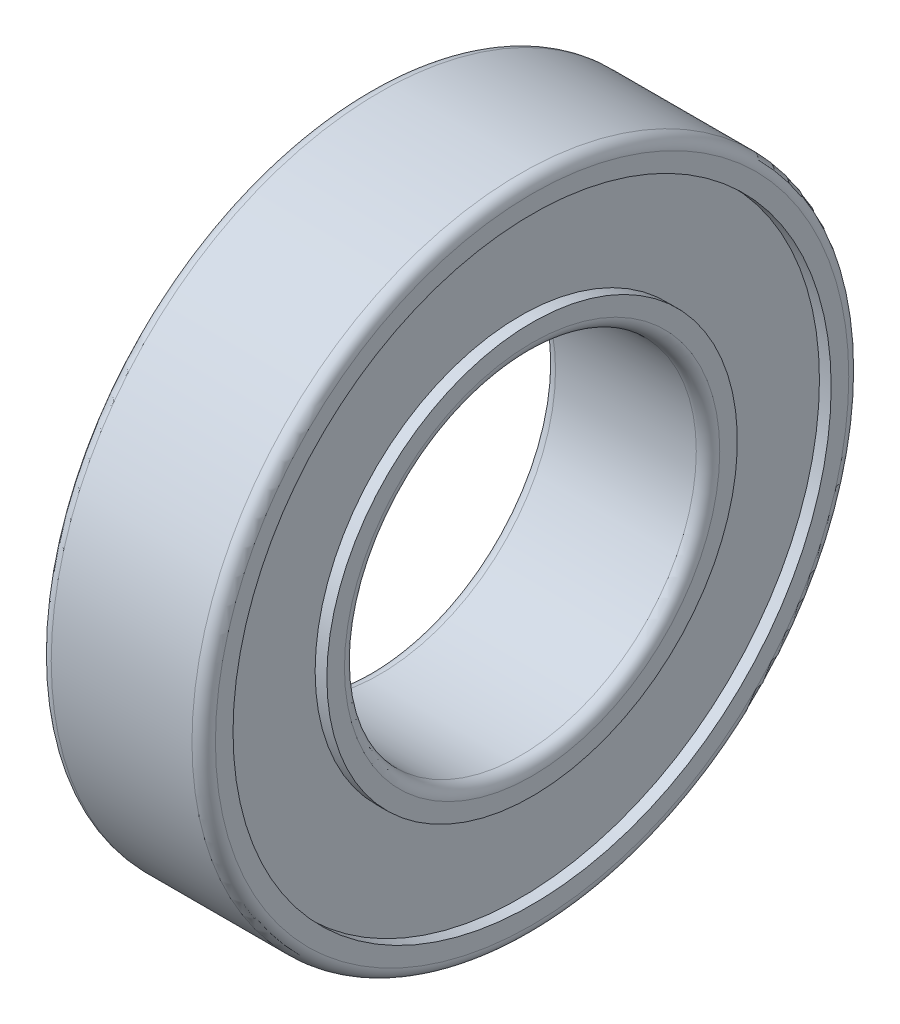
ISO-10303-21;
HEADER;
FILE_DESCRIPTION(('STEP AP214'),'2;1');
FILE_NAME('part.step','',(''),(''),'','','');
FILE_SCHEMA(('AUTOMOTIVE_DESIGN { 1 0 10303 214 1 1 1 1 }'));
ENDSEC;
DATA;
#1=APPLICATION_CONTEXT('core data for automotive mechanical design processes');
#2=APPLICATION_PROTOCOL_DEFINITION('international standard','automotive_design',2000,#1);
#3=PRODUCT_CONTEXT('',#1,'mechanical');
#4=PRODUCT('Part','Part','',(#3));
#5=PRODUCT_RELATED_PRODUCT_CATEGORY('part','',(#4));
#6=PRODUCT_DEFINITION_FORMATION('','',#4);
#7=PRODUCT_DEFINITION_CONTEXT('part definition',#1,'design');
#8=PRODUCT_DEFINITION('design','',#6,#7);
#9=PRODUCT_DEFINITION_SHAPE('','',#8);
#10=(LENGTH_UNIT() NAMED_UNIT(*) SI_UNIT(.MILLI.,.METRE.));
#11=(NAMED_UNIT(*) PLANE_ANGLE_UNIT() SI_UNIT($,.RADIAN.));
#12=(NAMED_UNIT(*) SI_UNIT($,.STERADIAN.) SOLID_ANGLE_UNIT());
#13=UNCERTAINTY_MEASURE_WITH_UNIT(LENGTH_MEASURE(1.E-05),#10,'distance_accuracy_value','');
#14=(GEOMETRIC_REPRESENTATION_CONTEXT(3) GLOBAL_UNCERTAINTY_ASSIGNED_CONTEXT((#13)) GLOBAL_UNIT_ASSIGNED_CONTEXT((#10,
#11,#12)) REPRESENTATION_CONTEXT('',''));
#15=CARTESIAN_POINT('',(0.,0.,0.));
#16=DIRECTION('',(0.,0.,1.));
#17=DIRECTION('',(1.,0.,0.));
#18=AXIS2_PLACEMENT_3D('',#15,#16,#17);
#19=CARTESIAN_POINT('',(0.5,12.75,0.));
#20=DIRECTION('',(1.,0.,0.));
#21=DIRECTION('',(0.,0.,-1.));
#22=AXIS2_PLACEMENT_3D('',#19,#20,#21);
#23=PLANE('',#22);
#24=CARTESIAN_POINT('',(0.5,0.,0.));
#25=DIRECTION('',(-1.,0.,0.));
#26=DIRECTION('',(0.,0.,1.));
#27=AXIS2_PLACEMENT_3D('',#24,#25,#26);
#28=CIRCLE('',#27,12.75);
#29=CARTESIAN_POINT('',(0.5,0.,12.75));
#30=VERTEX_POINT('',#29);
#31=EDGE_CURVE('E298',#30,#30,#28,.T.);
#32=ORIENTED_EDGE('',*,*,#31,.T.);
#33=EDGE_LOOP('',(#32));
#34=FACE_BOUND('',#33,.T.);
#35=CARTESIAN_POINT('',(0.5,0.,0.));
#36=DIRECTION('',(-1.,0.,0.));
#37=DIRECTION('',(0.,0.,1.));
#38=AXIS2_PLACEMENT_3D('',#35,#36,#37);
#39=CIRCLE('',#38,8.75);
#40=CARTESIAN_POINT('',(0.5,0.,8.75));
#41=VERTEX_POINT('',#40);
#42=EDGE_CURVE('E296',#41,#41,#39,.T.);
#43=ORIENTED_EDGE('',*,*,#42,.F.);
#44=EDGE_LOOP('',(#43));
#45=FACE_BOUND('',#44,.T.);
#46=ADVANCED_FACE('F16',(#34,#45),#23,.F.);
#47=CARTESIAN_POINT('',(0.,0.,0.));
#48=DIRECTION('',(-1.,0.,0.));
#49=DIRECTION('',(0.,0.,1.));
#50=AXIS2_PLACEMENT_3D('',#47,#48,#49);
#51=CYLINDRICAL_SURFACE('',#50,12.75);
#52=ORIENTED_EDGE('',*,*,#31,.F.);
#53=EDGE_LOOP('',(#52));
#54=FACE_BOUND('',#53,.T.);
#55=CARTESIAN_POINT('',(0.,0.,0.));
#56=DIRECTION('',(-1.,0.,0.));
#57=DIRECTION('',(0.,0.,1.));
#58=AXIS2_PLACEMENT_3D('',#55,#56,#57);
#59=CIRCLE('',#58,12.75);
#60=CARTESIAN_POINT('',(0.,0.,12.75));
#61=VERTEX_POINT('',#60);
#62=EDGE_CURVE('E293',#61,#61,#59,.T.);
#63=ORIENTED_EDGE('',*,*,#62,.T.);
#64=EDGE_LOOP('',(#63));
#65=FACE_BOUND('',#64,.T.);
#66=ADVANCED_FACE('F101',(#54,#65),#51,.F.);
#67=CARTESIAN_POINT('',(0.,0.,0.));
#68=DIRECTION('',(-1.,0.,0.));
#69=DIRECTION('',(0.,0.,1.));
#70=AXIS2_PLACEMENT_3D('',#67,#68,#69);
#71=CYLINDRICAL_SURFACE('',#70,8.75);
#72=CARTESIAN_POINT('',(0.,0.,0.));
#73=DIRECTION('',(-1.,0.,0.));
#74=DIRECTION('',(0.,0.,1.));
#75=AXIS2_PLACEMENT_3D('',#72,#73,#74);
#76=CIRCLE('',#75,8.75);
#77=CARTESIAN_POINT('',(0.,0.,8.75));
#78=VERTEX_POINT('',#77);
#79=EDGE_CURVE('E69',#78,#78,#76,.F.);
#80=ORIENTED_EDGE('',*,*,#79,.T.);
#81=EDGE_LOOP('',(#80));
#82=FACE_BOUND('',#81,.T.);
#83=ORIENTED_EDGE('',*,*,#42,.T.);
#84=EDGE_LOOP('',(#83));
#85=FACE_BOUND('',#84,.T.);
#86=ADVANCED_FACE('F89',(#82,#85),#71,.T.);
#87=CARTESIAN_POINT('',(0.,14.,0.));
#88=DIRECTION('',(1.,0.,0.));
#89=DIRECTION('',(0.,0.,-1.));
#90=AXIS2_PLACEMENT_3D('',#87,#88,#89);
#91=PLANE('',#90);
#92=ORIENTED_EDGE('',*,*,#62,.F.);
#93=EDGE_LOOP('',(#92));
#94=FACE_BOUND('',#93,.T.);
#95=CARTESIAN_POINT('',(0.,0.,0.));
#96=DIRECTION('',(1.,0.,0.));
#97=DIRECTION('',(0.,0.,-1.));
#98=AXIS2_PLACEMENT_3D('',#95,#96,#97);
#99=CIRCLE('',#98,13.5);
#100=CARTESIAN_POINT('',(0.,0.,-13.5));
#101=VERTEX_POINT('',#100);
#102=CARTESIAN_POINT('',(0.,0.,13.5));
#103=VERTEX_POINT('',#102);
#104=EDGE_CURVE('E56',#101,#103,#99,.T.);
#105=ORIENTED_EDGE('',*,*,#104,.F.);
#106=CARTESIAN_POINT('',(0.,0.,0.));
#107=DIRECTION('',(1.,0.,0.));
#108=DIRECTION('',(0.,0.,1.));
#109=AXIS2_PLACEMENT_3D('',#106,#107,#108);
#110=CIRCLE('',#109,13.5);
#111=EDGE_CURVE('E58',#103,#101,#110,.T.);
#112=ORIENTED_EDGE('',*,*,#111,.F.);
#113=EDGE_LOOP('',(#105,#112));
#114=FACE_BOUND('',#113,.T.);
#115=ADVANCED_FACE('F68',(#94,#114),#91,.F.);
#116=CARTESIAN_POINT('',(0.,8.75,0.));
#117=DIRECTION('',(1.,0.,0.));
#118=DIRECTION('',(0.,0.,-1.));
#119=AXIS2_PLACEMENT_3D('',#116,#117,#118);
#120=PLANE('',#119);
#121=ORIENTED_EDGE('',*,*,#79,.F.);
#122=EDGE_LOOP('',(#121));
#123=FACE_BOUND('',#122,.T.);
#124=CARTESIAN_POINT('',(0.,0.,0.));
#125=DIRECTION('',(-1.,0.,0.));
#126=DIRECTION('',(0.,0.,-1.));
#127=AXIS2_PLACEMENT_3D('',#124,#125,#126);
#128=CIRCLE('',#127,8.);
#129=CARTESIAN_POINT('',(0.,0.,-8.));
#130=VERTEX_POINT('',#129);
#131=CARTESIAN_POINT('',(0.,0.,8.));
#132=VERTEX_POINT('',#131);
#133=EDGE_CURVE('E64',#130,#132,#128,.T.);
#134=ORIENTED_EDGE('',*,*,#133,.F.);
#135=CARTESIAN_POINT('',(0.,0.,0.));
#136=DIRECTION('',(-1.,0.,0.));
#137=DIRECTION('',(0.,0.,1.));
#138=AXIS2_PLACEMENT_3D('',#135,#136,#137);
#139=CIRCLE('',#138,8.);
#140=EDGE_CURVE('E240',#132,#130,#139,.T.);
#141=ORIENTED_EDGE('',*,*,#140,.F.);
#142=EDGE_LOOP('',(#134,#141));
#143=FACE_BOUND('',#142,.T.);
#144=ADVANCED_FACE('F88',(#123,#143),#120,.F.);
#145=CARTESIAN_POINT('',(0.500000000000002,0.,0.));
#146=DIRECTION('',(1.,0.,0.));
#147=DIRECTION('',(0.,0.,-1.));
#148=AXIS2_PLACEMENT_3D('',#145,#146,#147);
#149=TOROIDAL_SURFACE('',#148,13.5,0.5);
#150=ORIENTED_EDGE('',*,*,#104,.T.);
#151=ORIENTED_EDGE('',*,*,#111,.T.);
#152=EDGE_LOOP('',(#150,#151));
#153=FACE_BOUND('',#152,.T.);
#154=CARTESIAN_POINT('',(0.500000000000002,0.,0.));
#155=DIRECTION('',(-1.,0.,0.));
#156=DIRECTION('',(0.,0.,1.));
#157=AXIS2_PLACEMENT_3D('',#154,#155,#156);
#158=CIRCLE('',#157,14.);
#159=CARTESIAN_POINT('',(0.500000000000002,0.,14.));
#160=VERTEX_POINT('',#159);
#161=EDGE_CURVE('E237',#160,#160,#158,.F.);
#162=ORIENTED_EDGE('',*,*,#161,.F.);
#163=EDGE_LOOP('',(#162));
#164=FACE_BOUND('',#163,.T.);
#165=ADVANCED_FACE('F60',(#153,#164),#149,.T.);
#166=CARTESIAN_POINT('',(0.5,0.,0.));
#167=DIRECTION('',(1.,0.,0.));
#168=DIRECTION('',(0.,0.,-1.));
#169=AXIS2_PLACEMENT_3D('',#166,#167,#168);
#170=TOROIDAL_SURFACE('',#169,8.,0.5);
#171=ORIENTED_EDGE('',*,*,#133,.T.);
#172=ORIENTED_EDGE('',*,*,#140,.T.);
#173=EDGE_LOOP('',(#171,#172));
#174=FACE_BOUND('',#173,.T.);
#175=CARTESIAN_POINT('',(0.5,0.,0.));
#176=DIRECTION('',(-1.,0.,0.));
#177=DIRECTION('',(0.,0.,1.));
#178=AXIS2_PLACEMENT_3D('',#175,#176,#177);
#179=CIRCLE('',#178,7.5);
#180=CARTESIAN_POINT('',(0.5,0.,7.5));
#181=VERTEX_POINT('',#180);
#182=EDGE_CURVE('E233',#181,#181,#179,.F.);
#183=ORIENTED_EDGE('',*,*,#182,.T.);
#184=EDGE_LOOP('',(#183));
#185=FACE_BOUND('',#184,.T.);
#186=ADVANCED_FACE('F217',(#174,#185),#170,.T.);
#187=CARTESIAN_POINT('',(0.,0.,0.));
#188=DIRECTION('',(-1.,0.,0.));
#189=DIRECTION('',(0.,0.,1.));
#190=AXIS2_PLACEMENT_3D('',#187,#188,#189);
#191=CYLINDRICAL_SURFACE('',#190,14.);
#192=CARTESIAN_POINT('',(6.5,0.,0.));
#193=DIRECTION('',(-1.,0.,0.));
#194=DIRECTION('',(0.,0.,1.));
#195=AXIS2_PLACEMENT_3D('',#192,#193,#194);
#196=CIRCLE('',#195,14.);
#197=CARTESIAN_POINT('',(6.5,0.,14.));
#198=VERTEX_POINT('',#197);
#199=EDGE_CURVE('E263',#198,#198,#196,.F.);
#200=ORIENTED_EDGE('',*,*,#199,.F.);
#201=EDGE_LOOP('',(#200));
#202=FACE_BOUND('',#201,.T.);
#203=ORIENTED_EDGE('',*,*,#161,.T.);
#204=EDGE_LOOP('',(#203));
#205=FACE_BOUND('',#204,.T.);
#206=ADVANCED_FACE('F227',(#202,#205),#191,.T.);
#207=CARTESIAN_POINT('',(0.,0.,0.));
#208=DIRECTION('',(-1.,0.,0.));
#209=DIRECTION('',(0.,0.,1.));
#210=AXIS2_PLACEMENT_3D('',#207,#208,#209);
#211=CYLINDRICAL_SURFACE('',#210,7.5);
#212=CARTESIAN_POINT('',(6.5,0.,0.));
#213=DIRECTION('',(-1.,0.,0.));
#214=DIRECTION('',(0.,0.,1.));
#215=AXIS2_PLACEMENT_3D('',#212,#213,#214);
#216=CIRCLE('',#215,7.5);
#217=CARTESIAN_POINT('',(6.5,0.,7.5));
#218=VERTEX_POINT('',#217);
#219=EDGE_CURVE('E265',#218,#218,#216,.T.);
#220=ORIENTED_EDGE('',*,*,#219,.F.);
#221=EDGE_LOOP('',(#220));
#222=FACE_BOUND('',#221,.T.);
#223=ORIENTED_EDGE('',*,*,#182,.F.);
#224=EDGE_LOOP('',(#223));
#225=FACE_BOUND('',#224,.T.);
#226=ADVANCED_FACE('F324',(#222,#225),#211,.F.);
#227=CARTESIAN_POINT('',(6.5,0.,0.));
#228=DIRECTION('',(-1.,0.,0.));
#229=DIRECTION('',(0.,0.,1.));
#230=AXIS2_PLACEMENT_3D('',#227,#228,#229);
#231=TOROIDAL_SURFACE('',#230,13.5,0.5);
#232=CARTESIAN_POINT('',(7.,0.,0.));
#233=DIRECTION('',(-1.,0.,0.));
#234=DIRECTION('',(0.,0.,1.));
#235=AXIS2_PLACEMENT_3D('',#232,#233,#234);
#236=CIRCLE('',#235,13.5);
#237=CARTESIAN_POINT('',(7.,0.,13.5));
#238=VERTEX_POINT('',#237);
#239=CARTESIAN_POINT('',(7.,0.,-13.5));
#240=VERTEX_POINT('',#239);
#241=EDGE_CURVE('E155',#238,#240,#236,.T.);
#242=ORIENTED_EDGE('',*,*,#241,.T.);
#243=CARTESIAN_POINT('',(7.,0.,0.));
#244=DIRECTION('',(-1.,0.,0.));
#245=DIRECTION('',(0.,0.,-1.));
#246=AXIS2_PLACEMENT_3D('',#243,#244,#245);
#247=CIRCLE('',#246,13.5);
#248=EDGE_CURVE('E166',#240,#238,#247,.T.);
#249=ORIENTED_EDGE('',*,*,#248,.T.);
#250=EDGE_LOOP('',(#242,#249));
#251=FACE_BOUND('',#250,.T.);
#252=ORIENTED_EDGE('',*,*,#199,.T.);
#253=EDGE_LOOP('',(#252));
#254=FACE_BOUND('',#253,.T.);
#255=ADVANCED_FACE('F182',(#251,#254),#231,.T.);
#256=CARTESIAN_POINT('',(6.5,0.,0.));
#257=DIRECTION('',(-1.,0.,0.));
#258=DIRECTION('',(0.,0.,1.));
#259=AXIS2_PLACEMENT_3D('',#256,#257,#258);
#260=TOROIDAL_SURFACE('',#259,8.,0.5);
#261=CARTESIAN_POINT('',(7.,0.,0.));
#262=DIRECTION('',(1.,0.,0.));
#263=DIRECTION('',(0.,0.,1.));
#264=AXIS2_PLACEMENT_3D('',#261,#262,#263);
#265=CIRCLE('',#264,8.);
#266=CARTESIAN_POINT('',(7.,0.,8.));
#267=VERTEX_POINT('',#266);
#268=CARTESIAN_POINT('',(7.,0.,-8.));
#269=VERTEX_POINT('',#268);
#270=EDGE_CURVE('E280',#267,#269,#265,.T.);
#271=ORIENTED_EDGE('',*,*,#270,.T.);
#272=CARTESIAN_POINT('',(7.,0.,0.));
#273=DIRECTION('',(1.,0.,0.));
#274=DIRECTION('',(0.,0.,-1.));
#275=AXIS2_PLACEMENT_3D('',#272,#273,#274);
#276=CIRCLE('',#275,8.);
#277=EDGE_CURVE('E35',#269,#267,#276,.T.);
#278=ORIENTED_EDGE('',*,*,#277,.T.);
#279=EDGE_LOOP('',(#271,#278));
#280=FACE_BOUND('',#279,.T.);
#281=ORIENTED_EDGE('',*,*,#219,.T.);
#282=EDGE_LOOP('',(#281));
#283=FACE_BOUND('',#282,.T.);
#284=ADVANCED_FACE('F178',(#280,#283),#260,.T.);
#285=CARTESIAN_POINT('',(7.,12.75,0.));
#286=DIRECTION('',(-1.,0.,0.));
#287=DIRECTION('',(0.,0.,1.));
#288=AXIS2_PLACEMENT_3D('',#285,#286,#287);
#289=PLANE('',#288);
#290=CARTESIAN_POINT('',(7.,0.,0.));
#291=DIRECTION('',(-1.,0.,0.));
#292=DIRECTION('',(0.,0.,1.));
#293=AXIS2_PLACEMENT_3D('',#290,#291,#292);
#294=CIRCLE('',#293,12.75);
#295=CARTESIAN_POINT('',(7.,0.,12.75));
#296=VERTEX_POINT('',#295);
#297=EDGE_CURVE('E281',#296,#296,#294,.T.);
#298=ORIENTED_EDGE('',*,*,#297,.T.);
#299=EDGE_LOOP('',(#298));
#300=FACE_BOUND('',#299,.T.);
#301=ORIENTED_EDGE('',*,*,#241,.F.);
#302=ORIENTED_EDGE('',*,*,#248,.F.);
#303=EDGE_LOOP('',(#301,#302));
#304=FACE_BOUND('',#303,.T.);
#305=ADVANCED_FACE('F134',(#300,#304),#289,.F.);
#306=CARTESIAN_POINT('',(7.,7.5,0.));
#307=DIRECTION('',(-1.,0.,0.));
#308=DIRECTION('',(0.,0.,1.));
#309=AXIS2_PLACEMENT_3D('',#306,#307,#308);
#310=PLANE('',#309);
#311=CARTESIAN_POINT('',(7.,0.,0.));
#312=DIRECTION('',(-1.,0.,0.));
#313=DIRECTION('',(0.,0.,1.));
#314=AXIS2_PLACEMENT_3D('',#311,#312,#313);
#315=CIRCLE('',#314,8.75);
#316=CARTESIAN_POINT('',(7.,0.,8.75));
#317=VERTEX_POINT('',#316);
#318=EDGE_CURVE('E283',#317,#317,#315,.T.);
#319=ORIENTED_EDGE('',*,*,#318,.F.);
#320=EDGE_LOOP('',(#319));
#321=FACE_BOUND('',#320,.T.);
#322=ORIENTED_EDGE('',*,*,#270,.F.);
#323=ORIENTED_EDGE('',*,*,#277,.F.);
#324=EDGE_LOOP('',(#322,#323));
#325=FACE_BOUND('',#324,.T.);
#326=ADVANCED_FACE('F129',(#321,#325),#310,.F.);
#327=CARTESIAN_POINT('',(0.,0.,0.));
#328=DIRECTION('',(-1.,0.,0.));
#329=DIRECTION('',(0.,0.,1.));
#330=AXIS2_PLACEMENT_3D('',#327,#328,#329);
#331=CYLINDRICAL_SURFACE('',#330,12.75);
#332=ORIENTED_EDGE('',*,*,#297,.F.);
#333=EDGE_LOOP('',(#332));
#334=FACE_BOUND('',#333,.T.);
#335=CARTESIAN_POINT('',(6.5,0.,0.));
#336=DIRECTION('',(-1.,0.,0.));
#337=DIRECTION('',(0.,0.,1.));
#338=AXIS2_PLACEMENT_3D('',#335,#336,#337);
#339=CIRCLE('',#338,12.75);
#340=CARTESIAN_POINT('',(6.5,0.,12.75));
#341=VERTEX_POINT('',#340);
#342=EDGE_CURVE('E27',#341,#341,#339,.T.);
#343=ORIENTED_EDGE('',*,*,#342,.T.);
#344=EDGE_LOOP('',(#343));
#345=FACE_BOUND('',#344,.T.);
#346=ADVANCED_FACE('F121',(#334,#345),#331,.F.);
#347=CARTESIAN_POINT('',(0.,0.,0.));
#348=DIRECTION('',(-1.,0.,0.));
#349=DIRECTION('',(0.,0.,1.));
#350=AXIS2_PLACEMENT_3D('',#347,#348,#349);
#351=CYLINDRICAL_SURFACE('',#350,8.75);
#352=CARTESIAN_POINT('',(6.5,0.,0.));
#353=DIRECTION('',(-1.,0.,0.));
#354=DIRECTION('',(0.,0.,1.));
#355=AXIS2_PLACEMENT_3D('',#352,#353,#354);
#356=CIRCLE('',#355,8.75);
#357=CARTESIAN_POINT('',(6.5,0.,8.75));
#358=VERTEX_POINT('',#357);
#359=EDGE_CURVE('E11',#358,#358,#356,.F.);
#360=ORIENTED_EDGE('',*,*,#359,.T.);
#361=EDGE_LOOP('',(#360));
#362=FACE_BOUND('',#361,.T.);
#363=ORIENTED_EDGE('',*,*,#318,.T.);
#364=EDGE_LOOP('',(#363));
#365=FACE_BOUND('',#364,.T.);
#366=ADVANCED_FACE('F115',(#362,#365),#351,.T.);
#367=CARTESIAN_POINT('',(6.5,8.75,0.));
#368=DIRECTION('',(-1.,0.,0.));
#369=DIRECTION('',(0.,0.,1.));
#370=AXIS2_PLACEMENT_3D('',#367,#368,#369);
#371=PLANE('',#370);
#372=ORIENTED_EDGE('',*,*,#359,.F.);
#373=EDGE_LOOP('',(#372));
#374=FACE_BOUND('',#373,.T.);
#375=ORIENTED_EDGE('',*,*,#342,.F.);
#376=EDGE_LOOP('',(#375));
#377=FACE_BOUND('',#376,.T.);
#378=ADVANCED_FACE('F113',(#374,#377),#371,.F.);
#379=CLOSED_SHELL('',(#46,#66,#86,#115,#144,#165,#186,#206,#226,#255,#284,#305,#326,#346,#366,#378));
#380=MANIFOLD_SOLID_BREP('B1',#379);
#381=ADVANCED_BREP_SHAPE_REPRESENTATION('',(#18,#380),#14);
#382=SHAPE_DEFINITION_REPRESENTATION(#9,#381);
ENDSEC;
END-ISO-10303-21;
